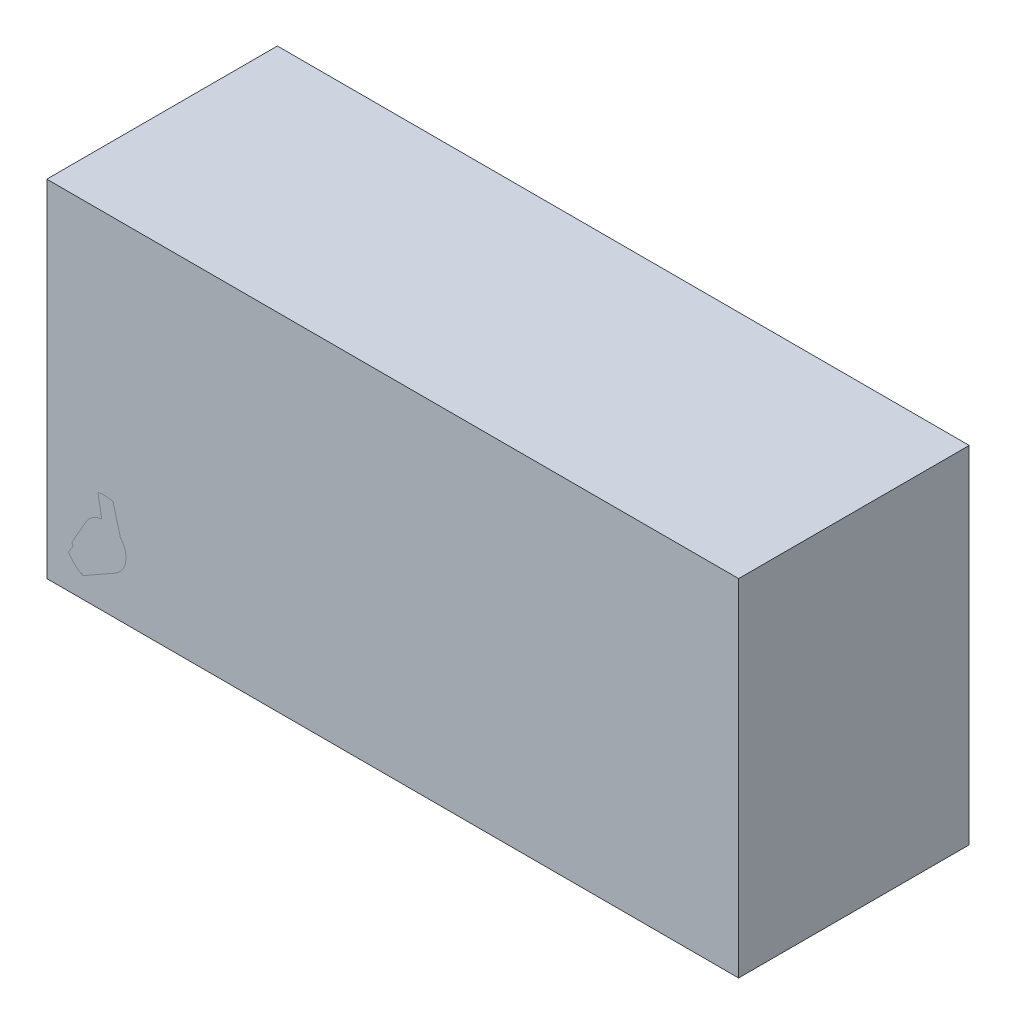
ISO-10303-21;
HEADER;
FILE_DESCRIPTION(('STEP AP214'),'2;1');
FILE_NAME('part.step','',(''),(''),'','','');
FILE_SCHEMA(('AUTOMOTIVE_DESIGN { 1 0 10303 214 1 1 1 1 }'));
ENDSEC;
DATA;
#1=APPLICATION_CONTEXT('core data for automotive mechanical design processes');
#2=APPLICATION_PROTOCOL_DEFINITION('international standard','automotive_design',2000,#1);
#3=PRODUCT_CONTEXT('',#1,'mechanical');
#4=PRODUCT('Part','Part','',(#3));
#5=PRODUCT_RELATED_PRODUCT_CATEGORY('part','',(#4));
#6=PRODUCT_DEFINITION_FORMATION('','',#4);
#7=PRODUCT_DEFINITION_CONTEXT('part definition',#1,'design');
#8=PRODUCT_DEFINITION('design','',#6,#7);
#9=PRODUCT_DEFINITION_SHAPE('','',#8);
#10=(LENGTH_UNIT() NAMED_UNIT(*) SI_UNIT(.MILLI.,.METRE.));
#11=(NAMED_UNIT(*) PLANE_ANGLE_UNIT() SI_UNIT($,.RADIAN.));
#12=(NAMED_UNIT(*) SI_UNIT($,.STERADIAN.) SOLID_ANGLE_UNIT());
#13=UNCERTAINTY_MEASURE_WITH_UNIT(LENGTH_MEASURE(1.E-05),#10,'distance_accuracy_value','');
#14=(GEOMETRIC_REPRESENTATION_CONTEXT(3) GLOBAL_UNCERTAINTY_ASSIGNED_CONTEXT((#13)) GLOBAL_UNIT_ASSIGNED_CONTEXT((#10,
#11,#12)) REPRESENTATION_CONTEXT('',''));
#15=CARTESIAN_POINT('',(0.,0.,0.));
#16=DIRECTION('',(0.,0.,1.));
#17=DIRECTION('',(1.,0.,0.));
#18=AXIS2_PLACEMENT_3D('',#15,#16,#17);
#19=CARTESIAN_POINT('',(-63.5,-25.4,38.1));
#20=DIRECTION('',(0.,0.,1.));
#21=DIRECTION('',(1.,0.,0.));
#22=AXIS2_PLACEMENT_3D('',#19,#20,#21);
#23=CYLINDRICAL_SURFACE('',#22,9.52500000000001);
#24=CARTESIAN_POINT('',(-63.5,-25.4,38.1));
#25=DIRECTION('',(0.,0.,1.));
#26=DIRECTION('',(1.,0.,0.));
#27=AXIS2_PLACEMENT_3D('',#24,#25,#26);
#28=CIRCLE('',#27,9.52500000000001);
#29=CARTESIAN_POINT('',(-53.975,-25.4,38.1));
#30=VERTEX_POINT('',#29);
#31=EDGE_CURVE('E11',#30,#30,#28,.T.);
#32=ORIENTED_EDGE('',*,*,#31,.T.);
#33=EDGE_LOOP('',(#32));
#34=FACE_BOUND('',#33,.T.);
#35=CARTESIAN_POINT('',(-63.5,-25.4,50.8));
#36=DIRECTION('',(0.,0.,1.));
#37=DIRECTION('',(1.,0.,0.));
#38=AXIS2_PLACEMENT_3D('',#35,#36,#37);
#39=CIRCLE('',#38,9.52500000000001);
#40=CARTESIAN_POINT('',(-53.975,-25.4,50.8));
#41=VERTEX_POINT('',#40);
#42=EDGE_CURVE('E50',#41,#41,#39,.T.);
#43=ORIENTED_EDGE('',*,*,#42,.F.);
#44=EDGE_LOOP('',(#43));
#45=FACE_BOUND('',#44,.T.);
#46=ADVANCED_FACE('F47',(#34,#45),#23,.T.);
#47=CARTESIAN_POINT('',(-63.5,-25.4,38.1));
#48=DIRECTION('',(0.,0.,1.));
#49=DIRECTION('',(1.,0.,0.));
#50=AXIS2_PLACEMENT_3D('',#47,#48,#49);
#51=PLANE('',#50);
#52=ORIENTED_EDGE('',*,*,#31,.F.);
#53=EDGE_LOOP('',(#52));
#54=FACE_BOUND('',#53,.T.);
#55=ADVANCED_FACE('F62',(#54),#51,.F.);
#56=CARTESIAN_POINT('',(-63.5,-25.4,50.8));
#57=DIRECTION('',(0.,0.,1.));
#58=DIRECTION('',(1.,0.,0.));
#59=AXIS2_PLACEMENT_3D('',#56,#57,#58);
#60=PLANE('',#59);
#61=ORIENTED_EDGE('',*,*,#42,.T.);
#62=EDGE_LOOP('',(#61));
#63=FACE_BOUND('',#62,.T.);
#64=ADVANCED_FACE('F59',(#63),#60,.T.);
#65=CLOSED_SHELL('',(#46,#55,#64));
#66=MANIFOLD_SOLID_BREP('B2',#65);
#67=CARTESIAN_POINT('',(76.2,-38.1,50.8));
#68=DIRECTION('',(-1.,0.,0.));
#69=DIRECTION('',(0.,0.,1.));
#70=AXIS2_PLACEMENT_3D('',#67,#68,#69);
#71=PLANE('',#70);
#72=DIRECTION('',(0.,1.,0.));
#73=VECTOR('',#72,1.);
#74=CARTESIAN_POINT('',(76.2,-38.1,0.));
#75=LINE('',#74,#73);
#76=CARTESIAN_POINT('',(76.2,-38.1,0.));
#77=VERTEX_POINT('',#76);
#78=CARTESIAN_POINT('',(76.2,38.1,0.));
#79=VERTEX_POINT('',#78);
#80=EDGE_CURVE('E156',#77,#79,#75,.T.);
#81=ORIENTED_EDGE('',*,*,#80,.T.);
#82=DIRECTION('',(0.,0.,-1.));
#83=VECTOR('',#82,1.);
#84=CARTESIAN_POINT('',(76.2,38.1,50.8));
#85=LINE('',#84,#83);
#86=CARTESIAN_POINT('',(76.2,38.1,50.8));
#87=VERTEX_POINT('',#86);
#88=EDGE_CURVE('E45',#87,#79,#85,.T.);
#89=ORIENTED_EDGE('',*,*,#88,.F.);
#90=DIRECTION('',(0.,1.,0.));
#91=VECTOR('',#90,1.);
#92=CARTESIAN_POINT('',(76.2,-38.1,50.8));
#93=LINE('',#92,#91);
#94=CARTESIAN_POINT('',(76.2,-38.1,50.8));
#95=VERTEX_POINT('',#94);
#96=EDGE_CURVE('E140',#95,#87,#93,.T.);
#97=ORIENTED_EDGE('',*,*,#96,.F.);
#98=DIRECTION('',(0.,0.,-1.));
#99=VECTOR('',#98,1.);
#100=CARTESIAN_POINT('',(76.2,-38.1,50.8));
#101=LINE('',#100,#99);
#102=EDGE_CURVE('E152',#95,#77,#101,.T.);
#103=ORIENTED_EDGE('',*,*,#102,.T.);
#104=EDGE_LOOP('',(#81,#89,#97,#103));
#105=FACE_BOUND('',#104,.T.);
#106=ADVANCED_FACE('F88',(#105),#71,.F.);
#107=CARTESIAN_POINT('',(-76.2,38.1,50.8));
#108=DIRECTION('',(0.,-1.,0.));
#109=DIRECTION('',(0.,0.,-1.));
#110=AXIS2_PLACEMENT_3D('',#107,#108,#109);
#111=PLANE('',#110);
#112=DIRECTION('',(-1.,0.,0.));
#113=VECTOR('',#112,1.);
#114=CARTESIAN_POINT('',(-76.2,38.1,0.));
#115=LINE('',#114,#113);
#116=CARTESIAN_POINT('',(-76.2,38.1,0.));
#117=VERTEX_POINT('',#116);
#118=EDGE_CURVE('E145',#79,#117,#115,.T.);
#119=ORIENTED_EDGE('',*,*,#118,.T.);
#120=DIRECTION('',(0.,0.,-1.));
#121=VECTOR('',#120,1.);
#122=CARTESIAN_POINT('',(-76.2,38.1,50.8));
#123=LINE('',#122,#121);
#124=CARTESIAN_POINT('',(-76.2,38.1,50.8));
#125=VERTEX_POINT('',#124);
#126=EDGE_CURVE('E97',#125,#117,#123,.T.);
#127=ORIENTED_EDGE('',*,*,#126,.F.);
#128=DIRECTION('',(-1.,0.,0.));
#129=VECTOR('',#128,1.);
#130=CARTESIAN_POINT('',(-76.2,38.1,50.8));
#131=LINE('',#130,#129);
#132=EDGE_CURVE('E135',#87,#125,#131,.T.);
#133=ORIENTED_EDGE('',*,*,#132,.F.);
#134=ORIENTED_EDGE('',*,*,#88,.T.);
#135=EDGE_LOOP('',(#119,#127,#133,#134));
#136=FACE_BOUND('',#135,.T.);
#137=ADVANCED_FACE('F144',(#136),#111,.F.);
#138=CARTESIAN_POINT('',(-76.2,-38.1,50.8));
#139=DIRECTION('',(1.,0.,0.));
#140=DIRECTION('',(0.,0.,-1.));
#141=AXIS2_PLACEMENT_3D('',#138,#139,#140);
#142=PLANE('',#141);
#143=DIRECTION('',(0.,-1.,0.));
#144=VECTOR('',#143,1.);
#145=CARTESIAN_POINT('',(-76.2,-38.1,0.));
#146=LINE('',#145,#144);
#147=CARTESIAN_POINT('',(-76.2,-38.1,0.));
#148=VERTEX_POINT('',#147);
#149=EDGE_CURVE('E122',#117,#148,#146,.T.);
#150=ORIENTED_EDGE('',*,*,#149,.T.);
#151=DIRECTION('',(0.,0.,-1.));
#152=VECTOR('',#151,1.);
#153=CARTESIAN_POINT('',(-76.2,-38.1,50.8));
#154=LINE('',#153,#152);
#155=CARTESIAN_POINT('',(-76.2,-38.1,50.8));
#156=VERTEX_POINT('',#155);
#157=EDGE_CURVE('E147',#156,#148,#154,.T.);
#158=ORIENTED_EDGE('',*,*,#157,.F.);
#159=DIRECTION('',(0.,-1.,0.));
#160=VECTOR('',#159,1.);
#161=CARTESIAN_POINT('',(-76.2,-38.1,50.8));
#162=LINE('',#161,#160);
#163=EDGE_CURVE('E138',#125,#156,#162,.T.);
#164=ORIENTED_EDGE('',*,*,#163,.F.);
#165=ORIENTED_EDGE('',*,*,#126,.T.);
#166=EDGE_LOOP('',(#150,#158,#164,#165));
#167=FACE_BOUND('',#166,.T.);
#168=ADVANCED_FACE('F148',(#167),#142,.F.);
#169=CARTESIAN_POINT('',(-76.2,-38.1,50.8));
#170=DIRECTION('',(0.,1.,0.));
#171=DIRECTION('',(0.,0.,1.));
#172=AXIS2_PLACEMENT_3D('',#169,#170,#171);
#173=PLANE('',#172);
#174=DIRECTION('',(1.,0.,0.));
#175=VECTOR('',#174,1.);
#176=CARTESIAN_POINT('',(-76.2,-38.1,0.));
#177=LINE('',#176,#175);
#178=EDGE_CURVE('E128',#148,#77,#177,.T.);
#179=ORIENTED_EDGE('',*,*,#178,.T.);
#180=ORIENTED_EDGE('',*,*,#102,.F.);
#181=DIRECTION('',(1.,0.,0.));
#182=VECTOR('',#181,1.);
#183=CARTESIAN_POINT('',(-76.2,-38.1,50.8));
#184=LINE('',#183,#182);
#185=EDGE_CURVE('E105',#156,#95,#184,.T.);
#186=ORIENTED_EDGE('',*,*,#185,.F.);
#187=ORIENTED_EDGE('',*,*,#157,.T.);
#188=EDGE_LOOP('',(#179,#180,#186,#187));
#189=FACE_BOUND('',#188,.T.);
#190=ADVANCED_FACE('F170',(#189),#173,.F.);
#191=CARTESIAN_POINT('',(0.,0.,50.8));
#192=DIRECTION('',(0.,0.,-1.));
#193=DIRECTION('',(-1.,0.,0.));
#194=AXIS2_PLACEMENT_3D('',#191,#192,#193);
#195=PLANE('',#194);
#196=CARTESIAN_POINT('',(-63.5,-25.4,50.8));
#197=DIRECTION('',(0.,0.,1.));
#198=DIRECTION('',(1.,0.,0.));
#199=AXIS2_PLACEMENT_3D('',#196,#197,#198);
#200=CIRCLE('',#199,4.7625);
#201=CARTESIAN_POINT('',(-58.7375,-25.4,50.8));
#202=VERTEX_POINT('',#201);
#203=EDGE_CURVE('E177',#202,#202,#200,.T.);
#204=ORIENTED_EDGE('',*,*,#203,.F.);
#205=EDGE_LOOP('',(#204));
#206=FACE_BOUND('',#205,.T.);
#207=ORIENTED_EDGE('',*,*,#96,.T.);
#208=ORIENTED_EDGE('',*,*,#132,.T.);
#209=ORIENTED_EDGE('',*,*,#163,.T.);
#210=ORIENTED_EDGE('',*,*,#185,.T.);
#211=EDGE_LOOP('',(#207,#208,#209,#210));
#212=FACE_BOUND('',#211,.T.);
#213=ADVANCED_FACE('F136',(#206,#212),#195,.F.);
#214=CARTESIAN_POINT('',(0.,0.,0.));
#215=DIRECTION('',(0.,0.,-1.));
#216=DIRECTION('',(-1.,0.,0.));
#217=AXIS2_PLACEMENT_3D('',#214,#215,#216);
#218=PLANE('',#217);
#219=CARTESIAN_POINT('',(-63.5,25.4,0.));
#220=DIRECTION('',(0.,0.,-1.));
#221=DIRECTION('',(-1.,0.,0.));
#222=AXIS2_PLACEMENT_3D('',#219,#220,#221);
#223=CIRCLE('',#222,4.7625);
#224=CARTESIAN_POINT('',(-68.2625,25.4,0.));
#225=VERTEX_POINT('',#224);
#226=EDGE_CURVE('E193',#225,#225,#223,.T.);
#227=ORIENTED_EDGE('',*,*,#226,.F.);
#228=EDGE_LOOP('',(#227));
#229=FACE_BOUND('',#228,.T.);
#230=CARTESIAN_POINT('',(63.5,25.4,0.));
#231=DIRECTION('',(0.,0.,-1.));
#232=DIRECTION('',(-1.,0.,0.));
#233=AXIS2_PLACEMENT_3D('',#230,#231,#232);
#234=CIRCLE('',#233,4.7625);
#235=CARTESIAN_POINT('',(58.7375,25.4,0.));
#236=VERTEX_POINT('',#235);
#237=EDGE_CURVE('E185',#236,#236,#234,.T.);
#238=ORIENTED_EDGE('',*,*,#237,.F.);
#239=EDGE_LOOP('',(#238));
#240=FACE_BOUND('',#239,.T.);
#241=ORIENTED_EDGE('',*,*,#80,.F.);
#242=ORIENTED_EDGE('',*,*,#178,.F.);
#243=ORIENTED_EDGE('',*,*,#149,.F.);
#244=ORIENTED_EDGE('',*,*,#118,.F.);
#245=EDGE_LOOP('',(#241,#242,#243,#244));
#246=FACE_BOUND('',#245,.T.);
#247=ADVANCED_FACE('F173',(#229,#240,#246),#218,.T.);
#248=CARTESIAN_POINT('',(-63.5,-25.4,38.1));
#249=DIRECTION('',(0.,0.,1.));
#250=DIRECTION('',(1.,0.,0.));
#251=AXIS2_PLACEMENT_3D('',#248,#249,#250);
#252=CYLINDRICAL_SURFACE('',#251,4.7625);
#253=CARTESIAN_POINT('',(-63.5,-25.4,38.1));
#254=DIRECTION('',(0.,0.,1.));
#255=DIRECTION('',(1.,0.,0.));
#256=AXIS2_PLACEMENT_3D('',#253,#254,#255);
#257=CIRCLE('',#256,4.7625);
#258=CARTESIAN_POINT('',(-58.7375,-25.4,38.1));
#259=VERTEX_POINT('',#258);
#260=EDGE_CURVE('E160',#259,#259,#257,.T.);
#261=ORIENTED_EDGE('',*,*,#260,.F.);
#262=EDGE_LOOP('',(#261));
#263=FACE_BOUND('',#262,.T.);
#264=ORIENTED_EDGE('',*,*,#203,.T.);
#265=EDGE_LOOP('',(#264));
#266=FACE_BOUND('',#265,.T.);
#267=ADVANCED_FACE('F212',(#263,#266),#252,.F.);
#268=CARTESIAN_POINT('',(-63.5,-25.4,38.1));
#269=DIRECTION('',(0.,0.,1.));
#270=DIRECTION('',(1.,0.,0.));
#271=AXIS2_PLACEMENT_3D('',#268,#269,#270);
#272=PLANE('',#271);
#273=ORIENTED_EDGE('',*,*,#260,.T.);
#274=EDGE_LOOP('',(#273));
#275=FACE_BOUND('',#274,.T.);
#276=ADVANCED_FACE('F218',(#275),#272,.T.);
#277=CARTESIAN_POINT('',(63.5,25.4,12.7));
#278=DIRECTION('',(0.,0.,-1.));
#279=DIRECTION('',(-1.,0.,0.));
#280=AXIS2_PLACEMENT_3D('',#277,#278,#279);
#281=CYLINDRICAL_SURFACE('',#280,4.7625);
#282=CARTESIAN_POINT('',(63.5,25.4,12.7));
#283=DIRECTION('',(0.,0.,-1.));
#284=DIRECTION('',(-1.,0.,0.));
#285=AXIS2_PLACEMENT_3D('',#282,#283,#284);
#286=CIRCLE('',#285,4.7625);
#287=CARTESIAN_POINT('',(58.7375,25.4,12.7));
#288=VERTEX_POINT('',#287);
#289=EDGE_CURVE('E189',#288,#288,#286,.T.);
#290=ORIENTED_EDGE('',*,*,#289,.F.);
#291=EDGE_LOOP('',(#290));
#292=FACE_BOUND('',#291,.T.);
#293=ORIENTED_EDGE('',*,*,#237,.T.);
#294=EDGE_LOOP('',(#293));
#295=FACE_BOUND('',#294,.T.);
#296=ADVANCED_FACE('F216',(#292,#295),#281,.F.);
#297=CARTESIAN_POINT('',(63.5,25.4,12.7));
#298=DIRECTION('',(0.,0.,-1.));
#299=DIRECTION('',(-1.,0.,0.));
#300=AXIS2_PLACEMENT_3D('',#297,#298,#299);
#301=PLANE('',#300);
#302=ORIENTED_EDGE('',*,*,#289,.T.);
#303=EDGE_LOOP('',(#302));
#304=FACE_BOUND('',#303,.T.);
#305=ADVANCED_FACE('F206',(#304),#301,.T.);
#306=CARTESIAN_POINT('',(-63.5,25.4,12.7));
#307=DIRECTION('',(0.,0.,-1.));
#308=DIRECTION('',(-1.,0.,0.));
#309=AXIS2_PLACEMENT_3D('',#306,#307,#308);
#310=CYLINDRICAL_SURFACE('',#309,4.7625);
#311=CARTESIAN_POINT('',(-63.5,25.4,12.7));
#312=DIRECTION('',(0.,0.,-1.));
#313=DIRECTION('',(-1.,0.,0.));
#314=AXIS2_PLACEMENT_3D('',#311,#312,#313);
#315=CIRCLE('',#314,4.7625);
#316=CARTESIAN_POINT('',(-68.2625,25.4,12.7));
#317=VERTEX_POINT('',#316);
#318=EDGE_CURVE('E181',#317,#317,#315,.T.);
#319=ORIENTED_EDGE('',*,*,#318,.F.);
#320=EDGE_LOOP('',(#319));
#321=FACE_BOUND('',#320,.T.);
#322=ORIENTED_EDGE('',*,*,#226,.T.);
#323=EDGE_LOOP('',(#322));
#324=FACE_BOUND('',#323,.T.);
#325=ADVANCED_FACE('F203',(#321,#324),#310,.F.);
#326=CARTESIAN_POINT('',(-63.5,25.4,12.7));
#327=DIRECTION('',(0.,0.,-1.));
#328=DIRECTION('',(-1.,0.,0.));
#329=AXIS2_PLACEMENT_3D('',#326,#327,#328);
#330=PLANE('',#329);
#331=ORIENTED_EDGE('',*,*,#318,.T.);
#332=EDGE_LOOP('',(#331));
#333=FACE_BOUND('',#332,.T.);
#334=ADVANCED_FACE('F201',(#333),#330,.T.);
#335=CLOSED_SHELL('',(#106,#137,#168,#190,#213,#247,#267,#276,#296,#305,#325,#334));
#336=MANIFOLD_SOLID_BREP('B6',#335);
#337=ADVANCED_BREP_SHAPE_REPRESENTATION('',(#18,#66,#336),#14);
#338=SHAPE_DEFINITION_REPRESENTATION(#9,#337);
ENDSEC;
END-ISO-10303-21;
